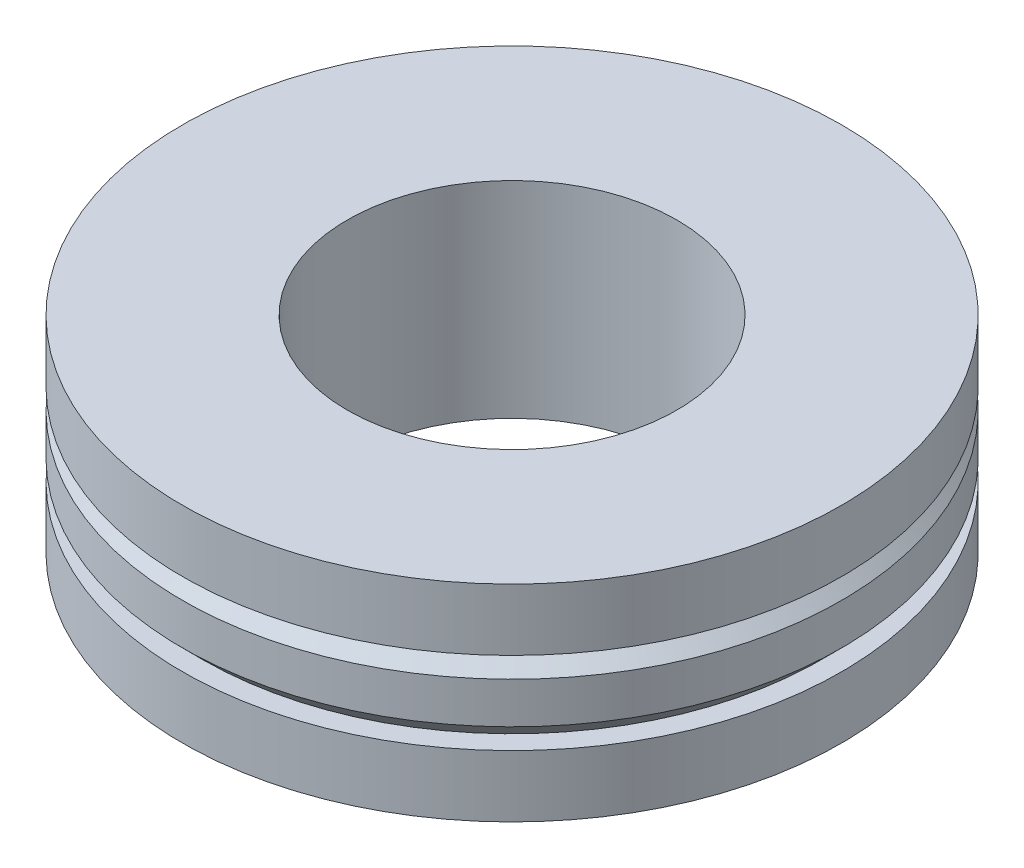
ISO-10303-21;
HEADER;
FILE_DESCRIPTION(('STEP AP214'),'2;1');
FILE_NAME('part.step','',(''),(''),'','','');
FILE_SCHEMA(('AUTOMOTIVE_DESIGN { 1 0 10303 214 1 1 1 1 }'));
ENDSEC;
DATA;
#1=APPLICATION_CONTEXT('core data for automotive mechanical design processes');
#2=APPLICATION_PROTOCOL_DEFINITION('international standard','automotive_design',2000,#1);
#3=PRODUCT_CONTEXT('',#1,'mechanical');
#4=PRODUCT('Part','Part','',(#3));
#5=PRODUCT_RELATED_PRODUCT_CATEGORY('part','',(#4));
#6=PRODUCT_DEFINITION_FORMATION('','',#4);
#7=PRODUCT_DEFINITION_CONTEXT('part definition',#1,'design');
#8=PRODUCT_DEFINITION('design','',#6,#7);
#9=PRODUCT_DEFINITION_SHAPE('','',#8);
#10=(LENGTH_UNIT() NAMED_UNIT(*) SI_UNIT(.MILLI.,.METRE.));
#11=(NAMED_UNIT(*) PLANE_ANGLE_UNIT() SI_UNIT($,.RADIAN.));
#12=(NAMED_UNIT(*) SI_UNIT($,.STERADIAN.) SOLID_ANGLE_UNIT());
#13=UNCERTAINTY_MEASURE_WITH_UNIT(LENGTH_MEASURE(1.E-05),#10,'distance_accuracy_value','');
#14=(GEOMETRIC_REPRESENTATION_CONTEXT(3) GLOBAL_UNCERTAINTY_ASSIGNED_CONTEXT((#13)) GLOBAL_UNIT_ASSIGNED_CONTEXT((#10,
#11,#12)) REPRESENTATION_CONTEXT('',''));
#15=CARTESIAN_POINT('',(0.,0.,0.));
#16=DIRECTION('',(0.,0.,1.));
#17=DIRECTION('',(1.,0.,0.));
#18=AXIS2_PLACEMENT_3D('',#15,#16,#17);
#19=CARTESIAN_POINT('',(-120.,5.,0.));
#20=DIRECTION('',(0.,-1.,0.));
#21=DIRECTION('',(0.,0.,-1.));
#22=AXIS2_PLACEMENT_3D('',#19,#20,#21);
#23=CYLINDRICAL_SURFACE('',#22,8.00000000000001);
#24=CARTESIAN_POINT('',(-120.,5.,0.));
#25=DIRECTION('',(0.,-1.,0.));
#26=DIRECTION('',(0.,0.,-1.));
#27=AXIS2_PLACEMENT_3D('',#24,#25,#26);
#28=CIRCLE('',#27,8.00000000000001);
#29=CARTESIAN_POINT('',(-120.,5.,-8.00000000000001));
#30=VERTEX_POINT('',#29);
#31=EDGE_CURVE('E10',#30,#30,#28,.T.);
#32=ORIENTED_EDGE('',*,*,#31,.T.);
#33=EDGE_LOOP('',(#32));
#34=FACE_BOUND('',#33,.T.);
#35=CARTESIAN_POINT('',(-120.,3.5,0.));
#36=DIRECTION('',(0.,-1.,0.));
#37=DIRECTION('',(0.,0.,-1.));
#38=AXIS2_PLACEMENT_3D('',#35,#36,#37);
#39=CIRCLE('',#38,8.00000000000001);
#40=CARTESIAN_POINT('',(-120.,3.5,-8.00000000000001));
#41=VERTEX_POINT('',#40);
#42=EDGE_CURVE('E65',#41,#41,#39,.T.);
#43=ORIENTED_EDGE('',*,*,#42,.F.);
#44=EDGE_LOOP('',(#43));
#45=FACE_BOUND('',#44,.T.);
#46=ADVANCED_FACE('F31',(#34,#45),#23,.T.);
#47=CARTESIAN_POINT('',(-112.,5.,0.));
#48=DIRECTION('',(0.,1.,0.));
#49=DIRECTION('',(0.,0.,1.));
#50=AXIS2_PLACEMENT_3D('',#47,#48,#49);
#51=PLANE('',#50);
#52=CARTESIAN_POINT('',(-120.,5.,0.));
#53=DIRECTION('',(0.,-1.,0.));
#54=DIRECTION('',(0.,0.,-1.));
#55=AXIS2_PLACEMENT_3D('',#52,#53,#54);
#56=CIRCLE('',#55,4.);
#57=CARTESIAN_POINT('',(-120.,5.,-4.));
#58=VERTEX_POINT('',#57);
#59=EDGE_CURVE('E37',#58,#58,#56,.T.);
#60=ORIENTED_EDGE('',*,*,#59,.T.);
#61=EDGE_LOOP('',(#60));
#62=FACE_BOUND('',#61,.T.);
#63=ORIENTED_EDGE('',*,*,#31,.F.);
#64=EDGE_LOOP('',(#63));
#65=FACE_BOUND('',#64,.T.);
#66=ADVANCED_FACE('F73',(#62,#65),#51,.T.);
#67=CARTESIAN_POINT('',(-120.,5.,0.));
#68=DIRECTION('',(0.,-1.,0.));
#69=DIRECTION('',(0.,0.,-1.));
#70=AXIS2_PLACEMENT_3D('',#67,#68,#69);
#71=CYLINDRICAL_SURFACE('',#70,4.);
#72=CARTESIAN_POINT('',(-120.,0.,0.));
#73=DIRECTION('',(0.,-1.,0.));
#74=DIRECTION('',(0.,0.,-1.));
#75=AXIS2_PLACEMENT_3D('',#72,#73,#74);
#76=CIRCLE('',#75,4.);
#77=CARTESIAN_POINT('',(-120.,0.,-4.));
#78=VERTEX_POINT('',#77);
#79=EDGE_CURVE('E41',#78,#78,#76,.T.);
#80=ORIENTED_EDGE('',*,*,#79,.T.);
#81=EDGE_LOOP('',(#80));
#82=FACE_BOUND('',#81,.T.);
#83=ORIENTED_EDGE('',*,*,#59,.F.);
#84=EDGE_LOOP('',(#83));
#85=FACE_BOUND('',#84,.T.);
#86=ADVANCED_FACE('F77',(#82,#85),#71,.F.);
#87=CARTESIAN_POINT('',(-116.,0.,0.));
#88=DIRECTION('',(0.,-1.,0.));
#89=DIRECTION('',(0.,0.,-1.));
#90=AXIS2_PLACEMENT_3D('',#87,#88,#89);
#91=PLANE('',#90);
#92=CARTESIAN_POINT('',(-120.,0.,0.));
#93=DIRECTION('',(0.,-1.,0.));
#94=DIRECTION('',(0.,0.,-1.));
#95=AXIS2_PLACEMENT_3D('',#92,#93,#94);
#96=CIRCLE('',#95,8.00000000000001);
#97=CARTESIAN_POINT('',(-120.,0.,-8.00000000000001));
#98=VERTEX_POINT('',#97);
#99=EDGE_CURVE('E45',#98,#98,#96,.T.);
#100=ORIENTED_EDGE('',*,*,#99,.T.);
#101=EDGE_LOOP('',(#100));
#102=FACE_BOUND('',#101,.T.);
#103=ORIENTED_EDGE('',*,*,#79,.F.);
#104=EDGE_LOOP('',(#103));
#105=FACE_BOUND('',#104,.T.);
#106=ADVANCED_FACE('F81',(#102,#105),#91,.T.);
#107=CARTESIAN_POINT('',(-120.,5.,0.));
#108=DIRECTION('',(0.,-1.,0.));
#109=DIRECTION('',(0.,0.,-1.));
#110=AXIS2_PLACEMENT_3D('',#107,#108,#109);
#111=CYLINDRICAL_SURFACE('',#110,8.00000000000001);
#112=CARTESIAN_POINT('',(-120.,1.5,0.));
#113=DIRECTION('',(0.,-1.,0.));
#114=DIRECTION('',(0.,0.,-1.));
#115=AXIS2_PLACEMENT_3D('',#112,#113,#114);
#116=CIRCLE('',#115,8.00000000000001);
#117=CARTESIAN_POINT('',(-120.,1.5,-8.00000000000001));
#118=VERTEX_POINT('',#117);
#119=EDGE_CURVE('E50',#118,#118,#116,.T.);
#120=ORIENTED_EDGE('',*,*,#119,.T.);
#121=EDGE_LOOP('',(#120));
#122=FACE_BOUND('',#121,.T.);
#123=ORIENTED_EDGE('',*,*,#99,.F.);
#124=EDGE_LOOP('',(#123));
#125=FACE_BOUND('',#124,.T.);
#126=ADVANCED_FACE('F88',(#122,#125),#111,.T.);
#127=CARTESIAN_POINT('',(-112.,1.5,0.));
#128=DIRECTION('',(0.,1.,0.));
#129=DIRECTION('',(0.,0.,1.));
#130=AXIS2_PLACEMENT_3D('',#127,#128,#129);
#131=PLANE('',#130);
#132=CARTESIAN_POINT('',(-120.,1.5,0.));
#133=DIRECTION('',(0.,-1.,0.));
#134=DIRECTION('',(0.,0.,-1.));
#135=AXIS2_PLACEMENT_3D('',#132,#133,#134);
#136=CIRCLE('',#135,7.50000000000001);
#137=CARTESIAN_POINT('',(-120.,1.5,-7.50000000000001));
#138=VERTEX_POINT('',#137);
#139=EDGE_CURVE('E53',#138,#138,#136,.T.);
#140=ORIENTED_EDGE('',*,*,#139,.T.);
#141=EDGE_LOOP('',(#140));
#142=FACE_BOUND('',#141,.T.);
#143=ORIENTED_EDGE('',*,*,#119,.F.);
#144=EDGE_LOOP('',(#143));
#145=FACE_BOUND('',#144,.T.);
#146=ADVANCED_FACE('F92',(#142,#145),#131,.T.);
#147=CARTESIAN_POINT('',(-120.,1.5,0.));
#148=DIRECTION('',(0.,1.,0.));
#149=DIRECTION('',(0.,0.,1.));
#150=AXIS2_PLACEMENT_3D('',#147,#148,#149);
#151=CONICAL_SURFACE('',#150,7.50000000000001,0.785398163397449);
#152=CARTESIAN_POINT('',(-120.,2.,0.));
#153=DIRECTION('',(0.,-1.,0.));
#154=DIRECTION('',(0.,0.,-1.));
#155=AXIS2_PLACEMENT_3D('',#152,#153,#154);
#156=CIRCLE('',#155,8.00000000000001);
#157=CARTESIAN_POINT('',(-120.,2.,-8.00000000000001));
#158=VERTEX_POINT('',#157);
#159=EDGE_CURVE('E56',#158,#158,#156,.T.);
#160=ORIENTED_EDGE('',*,*,#159,.T.);
#161=EDGE_LOOP('',(#160));
#162=FACE_BOUND('',#161,.T.);
#163=ORIENTED_EDGE('',*,*,#139,.F.);
#164=EDGE_LOOP('',(#163));
#165=FACE_BOUND('',#164,.T.);
#166=ADVANCED_FACE('F96',(#162,#165),#151,.T.);
#167=CARTESIAN_POINT('',(-120.,5.,0.));
#168=DIRECTION('',(0.,-1.,0.));
#169=DIRECTION('',(0.,0.,-1.));
#170=AXIS2_PLACEMENT_3D('',#167,#168,#169);
#171=CYLINDRICAL_SURFACE('',#170,8.00000000000001);
#172=CARTESIAN_POINT('',(-120.,3.,0.));
#173=DIRECTION('',(0.,-1.,0.));
#174=DIRECTION('',(0.,0.,-1.));
#175=AXIS2_PLACEMENT_3D('',#172,#173,#174);
#176=CIRCLE('',#175,8.00000000000001);
#177=CARTESIAN_POINT('',(-120.,3.,-8.00000000000001));
#178=VERTEX_POINT('',#177);
#179=EDGE_CURVE('E59',#178,#178,#176,.T.);
#180=ORIENTED_EDGE('',*,*,#179,.T.);
#181=EDGE_LOOP('',(#180));
#182=FACE_BOUND('',#181,.T.);
#183=ORIENTED_EDGE('',*,*,#159,.F.);
#184=EDGE_LOOP('',(#183));
#185=FACE_BOUND('',#184,.T.);
#186=ADVANCED_FACE('F100',(#182,#185),#171,.T.);
#187=CARTESIAN_POINT('',(-120.,3.,0.));
#188=DIRECTION('',(0.,-1.,0.));
#189=DIRECTION('',(0.,0.,-1.));
#190=AXIS2_PLACEMENT_3D('',#187,#188,#189);
#191=CONICAL_SURFACE('',#190,8.00000000000001,0.785398163397449);
#192=CARTESIAN_POINT('',(-120.,3.5,0.));
#193=DIRECTION('',(0.,-1.,0.));
#194=DIRECTION('',(0.,0.,-1.));
#195=AXIS2_PLACEMENT_3D('',#192,#193,#194);
#196=CIRCLE('',#195,7.50000000000001);
#197=CARTESIAN_POINT('',(-120.,3.5,-7.50000000000001));
#198=VERTEX_POINT('',#197);
#199=EDGE_CURVE('E62',#198,#198,#196,.T.);
#200=ORIENTED_EDGE('',*,*,#199,.T.);
#201=EDGE_LOOP('',(#200));
#202=FACE_BOUND('',#201,.T.);
#203=ORIENTED_EDGE('',*,*,#179,.F.);
#204=EDGE_LOOP('',(#203));
#205=FACE_BOUND('',#204,.T.);
#206=ADVANCED_FACE('F104',(#202,#205),#191,.T.);
#207=CARTESIAN_POINT('',(-112.5,3.5,0.));
#208=DIRECTION('',(0.,-1.,0.));
#209=DIRECTION('',(0.,0.,-1.));
#210=AXIS2_PLACEMENT_3D('',#207,#208,#209);
#211=PLANE('',#210);
#212=ORIENTED_EDGE('',*,*,#42,.T.);
#213=EDGE_LOOP('',(#212));
#214=FACE_BOUND('',#213,.T.);
#215=ORIENTED_EDGE('',*,*,#199,.F.);
#216=EDGE_LOOP('',(#215));
#217=FACE_BOUND('',#216,.T.);
#218=ADVANCED_FACE('F69',(#214,#217),#211,.T.);
#219=CLOSED_SHELL('',(#46,#66,#86,#106,#126,#146,#166,#186,#206,#218));
#220=MANIFOLD_SOLID_BREP('B2',#219);
#221=ADVANCED_BREP_SHAPE_REPRESENTATION('',(#18,#220),#14);
#222=SHAPE_DEFINITION_REPRESENTATION(#9,#221);
ENDSEC;
END-ISO-10303-21;
